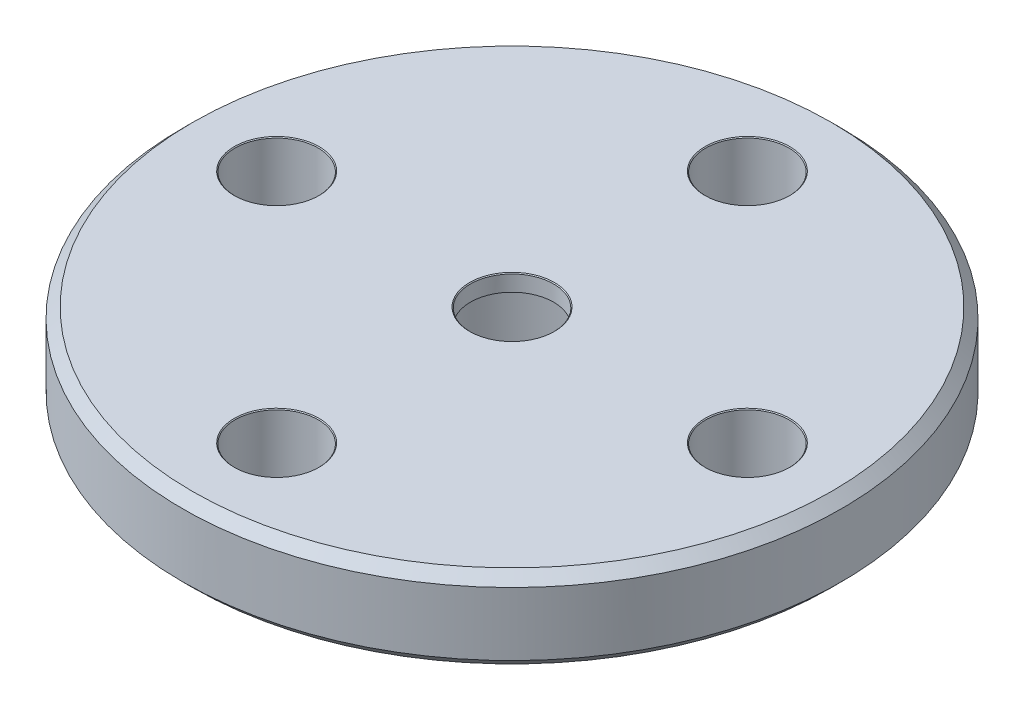
ISO-10303-21;
HEADER;
FILE_DESCRIPTION(('STEP AP214'),'2;1');
FILE_NAME('part.step','',(''),(''),'','','');
FILE_SCHEMA(('AUTOMOTIVE_DESIGN { 1 0 10303 214 1 1 1 1 }'));
ENDSEC;
DATA;
#1=APPLICATION_CONTEXT('core data for automotive mechanical design processes');
#2=APPLICATION_PROTOCOL_DEFINITION('international standard','automotive_design',2000,#1);
#3=PRODUCT_CONTEXT('',#1,'mechanical');
#4=PRODUCT('Part','Part','',(#3));
#5=PRODUCT_RELATED_PRODUCT_CATEGORY('part','',(#4));
#6=PRODUCT_DEFINITION_FORMATION('','',#4);
#7=PRODUCT_DEFINITION_CONTEXT('part definition',#1,'design');
#8=PRODUCT_DEFINITION('design','',#6,#7);
#9=PRODUCT_DEFINITION_SHAPE('','',#8);
#10=(LENGTH_UNIT() NAMED_UNIT(*) SI_UNIT(.MILLI.,.METRE.));
#11=(NAMED_UNIT(*) PLANE_ANGLE_UNIT() SI_UNIT($,.RADIAN.));
#12=(NAMED_UNIT(*) SI_UNIT($,.STERADIAN.) SOLID_ANGLE_UNIT());
#13=UNCERTAINTY_MEASURE_WITH_UNIT(LENGTH_MEASURE(1.E-05),#10,'distance_accuracy_value','');
#14=(GEOMETRIC_REPRESENTATION_CONTEXT(3) GLOBAL_UNCERTAINTY_ASSIGNED_CONTEXT((#13)) GLOBAL_UNIT_ASSIGNED_CONTEXT((#10,
#11,#12)) REPRESENTATION_CONTEXT('',''));
#15=CARTESIAN_POINT('',(0.,0.,0.));
#16=DIRECTION('',(0.,0.,1.));
#17=DIRECTION('',(1.,0.,0.));
#18=AXIS2_PLACEMENT_3D('',#15,#16,#17);
#19=CARTESIAN_POINT('',(0.,4.6,0.));
#20=DIRECTION('',(0.,1.,0.));
#21=DIRECTION('',(0.,0.,1.));
#22=AXIS2_PLACEMENT_3D('',#19,#20,#21);
#23=CYLINDRICAL_SURFACE('',#22,1.25);
#24=CARTESIAN_POINT('',(0.,4.575,0.));
#25=DIRECTION('',(0.,1.,0.));
#26=DIRECTION('',(0.,0.,1.));
#27=AXIS2_PLACEMENT_3D('',#24,#25,#26);
#28=CIRCLE('',#27,1.25);
#29=CARTESIAN_POINT('',(0.,4.575,1.25));
#30=VERTEX_POINT('',#29);
#31=EDGE_CURVE('E112',#30,#30,#28,.T.);
#32=ORIENTED_EDGE('',*,*,#31,.T.);
#33=EDGE_LOOP('',(#32));
#34=FACE_BOUND('',#33,.T.);
#35=CARTESIAN_POINT('',(0.,4.1,0.));
#36=DIRECTION('',(0.,-1.,0.));
#37=DIRECTION('',(0.,0.,-1.));
#38=AXIS2_PLACEMENT_3D('',#35,#36,#37);
#39=CIRCLE('',#38,1.25);
#40=CARTESIAN_POINT('',(0.,4.1,-1.25));
#41=VERTEX_POINT('',#40);
#42=EDGE_CURVE('E82',#41,#41,#39,.F.);
#43=ORIENTED_EDGE('',*,*,#42,.F.);
#44=EDGE_LOOP('',(#43));
#45=FACE_BOUND('',#44,.T.);
#46=ADVANCED_FACE('F45',(#34,#45),#23,.F.);
#47=CARTESIAN_POINT('',(0.,4.6,0.));
#48=DIRECTION('',(0.,-1.,0.));
#49=DIRECTION('',(0.,0.,-1.));
#50=AXIS2_PLACEMENT_3D('',#47,#48,#49);
#51=PLANE('',#50);
#52=CARTESIAN_POINT('',(7.07106781186547,4.6,0.));
#53=DIRECTION('',(0.,1.,0.));
#54=DIRECTION('',(0.,0.,1.));
#55=AXIS2_PLACEMENT_3D('',#52,#53,#54);
#56=CIRCLE('',#55,1.275);
#57=CARTESIAN_POINT('',(7.07106781186547,4.6,1.275));
#58=VERTEX_POINT('',#57);
#59=EDGE_CURVE('E88',#58,#58,#56,.T.);
#60=ORIENTED_EDGE('',*,*,#59,.F.);
#61=EDGE_LOOP('',(#60));
#62=FACE_BOUND('',#61,.T.);
#63=CARTESIAN_POINT('',(0.,4.6,7.07106781186547));
#64=DIRECTION('',(0.,1.,0.));
#65=DIRECTION('',(0.,0.,1.));
#66=AXIS2_PLACEMENT_3D('',#63,#64,#65);
#67=CIRCLE('',#66,1.275);
#68=CARTESIAN_POINT('',(0.,4.6,8.34606781186547));
#69=VERTEX_POINT('',#68);
#70=EDGE_CURVE('E80',#69,#69,#67,.T.);
#71=ORIENTED_EDGE('',*,*,#70,.F.);
#72=EDGE_LOOP('',(#71));
#73=FACE_BOUND('',#72,.T.);
#74=CARTESIAN_POINT('',(-7.07106781186547,4.6,0.));
#75=DIRECTION('',(0.,1.,0.));
#76=DIRECTION('',(0.,0.,1.));
#77=AXIS2_PLACEMENT_3D('',#74,#75,#76);
#78=CIRCLE('',#77,1.275);
#79=CARTESIAN_POINT('',(-7.07106781186547,4.6,1.275));
#80=VERTEX_POINT('',#79);
#81=EDGE_CURVE('E76',#80,#80,#78,.T.);
#82=ORIENTED_EDGE('',*,*,#81,.F.);
#83=EDGE_LOOP('',(#82));
#84=FACE_BOUND('',#83,.T.);
#85=CARTESIAN_POINT('',(0.,4.6,-7.07106781186547));
#86=DIRECTION('',(0.,1.,0.));
#87=DIRECTION('',(0.,0.,1.));
#88=AXIS2_PLACEMENT_3D('',#85,#86,#87);
#89=CIRCLE('',#88,1.275);
#90=CARTESIAN_POINT('',(0.,4.6,-5.79606781186547));
#91=VERTEX_POINT('',#90);
#92=EDGE_CURVE('E71',#91,#91,#89,.T.);
#93=ORIENTED_EDGE('',*,*,#92,.F.);
#94=EDGE_LOOP('',(#93));
#95=FACE_BOUND('',#94,.T.);
#96=CARTESIAN_POINT('',(0.,4.6,0.));
#97=DIRECTION('',(0.,-1.,0.));
#98=DIRECTION('',(0.,0.,-1.));
#99=AXIS2_PLACEMENT_3D('',#96,#97,#98);
#100=CIRCLE('',#99,9.6);
#101=CARTESIAN_POINT('',(0.,4.6,-9.6));
#102=VERTEX_POINT('',#101);
#103=EDGE_CURVE('E11',#102,#102,#100,.F.);
#104=ORIENTED_EDGE('',*,*,#103,.T.);
#105=EDGE_LOOP('',(#104));
#106=FACE_BOUND('',#105,.T.);
#107=CARTESIAN_POINT('',(0.,4.6,0.));
#108=DIRECTION('',(0.,1.,0.));
#109=DIRECTION('',(0.,0.,1.));
#110=AXIS2_PLACEMENT_3D('',#107,#108,#109);
#111=CIRCLE('',#110,1.275);
#112=CARTESIAN_POINT('',(0.,4.6,1.275));
#113=VERTEX_POINT('',#112);
#114=EDGE_CURVE('E66',#113,#113,#111,.T.);
#115=ORIENTED_EDGE('',*,*,#114,.F.);
#116=EDGE_LOOP('',(#115));
#117=FACE_BOUND('',#116,.T.);
#118=ADVANCED_FACE('F145',(#62,#73,#84,#95,#106,#117),#51,.F.);
#119=CARTESIAN_POINT('',(0.,0.,0.));
#120=DIRECTION('',(0.,1.,0.));
#121=DIRECTION('',(0.,0.,1.));
#122=AXIS2_PLACEMENT_3D('',#119,#120,#121);
#123=PLANE('',#122);
#124=CARTESIAN_POINT('',(0.,0.,0.));
#125=DIRECTION('',(0.,1.,0.));
#126=DIRECTION('',(0.,0.,1.));
#127=AXIS2_PLACEMENT_3D('',#124,#125,#126);
#128=CIRCLE('',#127,2.75);
#129=CARTESIAN_POINT('',(0.,0.,2.75));
#130=VERTEX_POINT('',#129);
#131=EDGE_CURVE('E50',#130,#130,#128,.T.);
#132=ORIENTED_EDGE('',*,*,#131,.T.);
#133=EDGE_LOOP('',(#132));
#134=FACE_BOUND('',#133,.T.);
#135=CARTESIAN_POINT('',(0.,0.,0.));
#136=DIRECTION('',(0.,1.,0.));
#137=DIRECTION('',(0.,0.,1.));
#138=AXIS2_PLACEMENT_3D('',#135,#136,#137);
#139=CIRCLE('',#138,4.65);
#140=CARTESIAN_POINT('',(0.,0.,4.65));
#141=VERTEX_POINT('',#140);
#142=EDGE_CURVE('E118',#141,#141,#139,.F.);
#143=ORIENTED_EDGE('',*,*,#142,.T.);
#144=EDGE_LOOP('',(#143));
#145=FACE_BOUND('',#144,.T.);
#146=ADVANCED_FACE('F151',(#134,#145),#123,.F.);
#147=CARTESIAN_POINT('',(0.,0.,0.));
#148=DIRECTION('',(0.,-1.,0.));
#149=DIRECTION('',(0.,0.,-1.));
#150=AXIS2_PLACEMENT_3D('',#147,#148,#149);
#151=CYLINDRICAL_SURFACE('',#150,4.95);
#152=CARTESIAN_POINT('',(0.,0.3,0.));
#153=DIRECTION('',(0.,1.,0.));
#154=DIRECTION('',(0.,0.,1.));
#155=AXIS2_PLACEMENT_3D('',#152,#153,#154);
#156=CIRCLE('',#155,4.95);
#157=CARTESIAN_POINT('',(0.,0.3,4.95));
#158=VERTEX_POINT('',#157);
#159=EDGE_CURVE('E121',#158,#158,#156,.T.);
#160=ORIENTED_EDGE('',*,*,#159,.T.);
#161=EDGE_LOOP('',(#160));
#162=FACE_BOUND('',#161,.T.);
#163=CARTESIAN_POINT('',(0.,2.1,0.));
#164=DIRECTION('',(0.,-1.,0.));
#165=DIRECTION('',(0.,0.,-1.));
#166=AXIS2_PLACEMENT_3D('',#163,#164,#165);
#167=CIRCLE('',#166,4.95);
#168=CARTESIAN_POINT('',(0.,2.1,-4.95));
#169=VERTEX_POINT('',#168);
#170=EDGE_CURVE('E115',#169,#169,#167,.T.);
#171=ORIENTED_EDGE('',*,*,#170,.T.);
#172=EDGE_LOOP('',(#171));
#173=FACE_BOUND('',#172,.T.);
#174=ADVANCED_FACE('F163',(#162,#173),#151,.T.);
#175=CARTESIAN_POINT('',(0.,2.1,0.));
#176=DIRECTION('',(0.,1.,0.));
#177=DIRECTION('',(0.,0.,1.));
#178=AXIS2_PLACEMENT_3D('',#175,#176,#177);
#179=PLANE('',#178);
#180=CARTESIAN_POINT('',(7.07106781186547,2.1,0.));
#181=DIRECTION('',(0.,1.,0.));
#182=DIRECTION('',(0.,0.,1.));
#183=AXIS2_PLACEMENT_3D('',#180,#181,#182);
#184=CIRCLE('',#183,1.25);
#185=CARTESIAN_POINT('',(7.07106781186547,2.1,1.25));
#186=VERTEX_POINT('',#185);
#187=EDGE_CURVE('E78',#186,#186,#184,.T.);
#188=ORIENTED_EDGE('',*,*,#187,.T.);
#189=EDGE_LOOP('',(#188));
#190=FACE_BOUND('',#189,.T.);
#191=CARTESIAN_POINT('',(0.,2.1,7.07106781186547));
#192=DIRECTION('',(0.,1.,0.));
#193=DIRECTION('',(0.,0.,1.));
#194=AXIS2_PLACEMENT_3D('',#191,#192,#193);
#195=CIRCLE('',#194,1.25);
#196=CARTESIAN_POINT('',(0.,2.1,8.32106781186547));
#197=VERTEX_POINT('',#196);
#198=EDGE_CURVE('E73',#197,#197,#195,.T.);
#199=ORIENTED_EDGE('',*,*,#198,.T.);
#200=EDGE_LOOP('',(#199));
#201=FACE_BOUND('',#200,.T.);
#202=CARTESIAN_POINT('',(-7.07106781186547,2.1,0.));
#203=DIRECTION('',(0.,1.,0.));
#204=DIRECTION('',(0.,0.,1.));
#205=AXIS2_PLACEMENT_3D('',#202,#203,#204);
#206=CIRCLE('',#205,1.25);
#207=CARTESIAN_POINT('',(-7.07106781186547,2.1,1.25));
#208=VERTEX_POINT('',#207);
#209=EDGE_CURVE('E68',#208,#208,#206,.T.);
#210=ORIENTED_EDGE('',*,*,#209,.T.);
#211=EDGE_LOOP('',(#210));
#212=FACE_BOUND('',#211,.T.);
#213=CARTESIAN_POINT('',(0.,2.1,-7.07106781186547));
#214=DIRECTION('',(0.,1.,0.));
#215=DIRECTION('',(0.,0.,1.));
#216=AXIS2_PLACEMENT_3D('',#213,#214,#215);
#217=CIRCLE('',#216,1.25);
#218=CARTESIAN_POINT('',(0.,2.1,-5.82106781186548));
#219=VERTEX_POINT('',#218);
#220=EDGE_CURVE('E63',#219,#219,#217,.T.);
#221=ORIENTED_EDGE('',*,*,#220,.T.);
#222=EDGE_LOOP('',(#221));
#223=FACE_BOUND('',#222,.T.);
#224=CARTESIAN_POINT('',(0.,2.1,0.));
#225=DIRECTION('',(0.,1.,0.));
#226=DIRECTION('',(0.,0.,1.));
#227=AXIS2_PLACEMENT_3D('',#224,#225,#226);
#228=CIRCLE('',#227,9.6);
#229=CARTESIAN_POINT('',(0.,2.1,9.6));
#230=VERTEX_POINT('',#229);
#231=EDGE_CURVE('E124',#230,#230,#228,.F.);
#232=ORIENTED_EDGE('',*,*,#231,.T.);
#233=EDGE_LOOP('',(#232));
#234=FACE_BOUND('',#233,.T.);
#235=ORIENTED_EDGE('',*,*,#170,.F.);
#236=EDGE_LOOP('',(#235));
#237=FACE_BOUND('',#236,.T.);
#238=ADVANCED_FACE('F159',(#190,#201,#212,#223,#234,#237),#179,.F.);
#239=CARTESIAN_POINT('',(0.,0.,0.));
#240=DIRECTION('',(0.,-1.,0.));
#241=DIRECTION('',(0.,0.,-1.));
#242=AXIS2_PLACEMENT_3D('',#239,#240,#241);
#243=CYLINDRICAL_SURFACE('',#242,9.9);
#244=CARTESIAN_POINT('',(0.,2.4,0.));
#245=DIRECTION('',(0.,1.,0.));
#246=DIRECTION('',(0.,0.,1.));
#247=AXIS2_PLACEMENT_3D('',#244,#245,#246);
#248=CIRCLE('',#247,9.9);
#249=CARTESIAN_POINT('',(0.,2.4,9.9));
#250=VERTEX_POINT('',#249);
#251=EDGE_CURVE('E54',#250,#250,#248,.T.);
#252=ORIENTED_EDGE('',*,*,#251,.T.);
#253=EDGE_LOOP('',(#252));
#254=FACE_BOUND('',#253,.T.);
#255=CARTESIAN_POINT('',(0.,4.3,0.));
#256=DIRECTION('',(0.,-1.,0.));
#257=DIRECTION('',(0.,0.,-1.));
#258=AXIS2_PLACEMENT_3D('',#255,#256,#257);
#259=CIRCLE('',#258,9.9);
#260=CARTESIAN_POINT('',(0.,4.3,-9.9));
#261=VERTEX_POINT('',#260);
#262=EDGE_CURVE('E59',#261,#261,#259,.T.);
#263=ORIENTED_EDGE('',*,*,#262,.T.);
#264=EDGE_LOOP('',(#263));
#265=FACE_BOUND('',#264,.T.);
#266=ADVANCED_FACE('F129',(#254,#265),#243,.T.);
#267=CARTESIAN_POINT('',(0.,0.,0.));
#268=DIRECTION('',(0.,1.,0.));
#269=DIRECTION('',(0.,0.,1.));
#270=AXIS2_PLACEMENT_3D('',#267,#268,#269);
#271=CONICAL_SURFACE('',#270,4.65,0.785398163397445);
#272=ORIENTED_EDGE('',*,*,#159,.F.);
#273=EDGE_LOOP('',(#272));
#274=FACE_BOUND('',#273,.T.);
#275=ORIENTED_EDGE('',*,*,#142,.F.);
#276=EDGE_LOOP('',(#275));
#277=FACE_BOUND('',#276,.T.);
#278=ADVANCED_FACE('F142',(#274,#277),#271,.T.);
#279=CARTESIAN_POINT('',(0.,2.1,0.));
#280=DIRECTION('',(0.,1.,0.));
#281=DIRECTION('',(0.,0.,1.));
#282=AXIS2_PLACEMENT_3D('',#279,#280,#281);
#283=CONICAL_SURFACE('',#282,9.6,0.785398163397445);
#284=ORIENTED_EDGE('',*,*,#251,.F.);
#285=EDGE_LOOP('',(#284));
#286=FACE_BOUND('',#285,.T.);
#287=ORIENTED_EDGE('',*,*,#231,.F.);
#288=EDGE_LOOP('',(#287));
#289=FACE_BOUND('',#288,.T.);
#290=ADVANCED_FACE('F133',(#286,#289),#283,.T.);
#291=CARTESIAN_POINT('',(0.,4.3,0.));
#292=DIRECTION('',(0.,-1.,0.));
#293=DIRECTION('',(0.,0.,-1.));
#294=AXIS2_PLACEMENT_3D('',#291,#292,#293);
#295=CONICAL_SURFACE('',#294,9.9,0.785398163397448);
#296=ORIENTED_EDGE('',*,*,#103,.F.);
#297=EDGE_LOOP('',(#296));
#298=FACE_BOUND('',#297,.T.);
#299=ORIENTED_EDGE('',*,*,#262,.F.);
#300=EDGE_LOOP('',(#299));
#301=FACE_BOUND('',#300,.T.);
#302=ADVANCED_FACE('F48',(#298,#301),#295,.T.);
#303=CARTESIAN_POINT('',(0.,4.6,0.));
#304=DIRECTION('',(0.,1.,0.));
#305=DIRECTION('',(0.,0.,1.));
#306=AXIS2_PLACEMENT_3D('',#303,#304,#305);
#307=CONICAL_SURFACE('',#306,1.275,0.785398163397461);
#308=ORIENTED_EDGE('',*,*,#31,.F.);
#309=EDGE_LOOP('',(#308));
#310=FACE_BOUND('',#309,.T.);
#311=ORIENTED_EDGE('',*,*,#114,.T.);
#312=EDGE_LOOP('',(#311));
#313=FACE_BOUND('',#312,.T.);
#314=ADVANCED_FACE('F132',(#310,#313),#307,.F.);
#315=CARTESIAN_POINT('',(0.,4.6,-7.07106781186547));
#316=DIRECTION('',(0.,1.,0.));
#317=DIRECTION('',(0.,0.,1.));
#318=AXIS2_PLACEMENT_3D('',#315,#316,#317);
#319=CYLINDRICAL_SURFACE('',#318,1.25);
#320=CARTESIAN_POINT('',(0.,4.575,-7.07106781186547));
#321=DIRECTION('',(0.,1.,0.));
#322=DIRECTION('',(0.,0.,1.));
#323=AXIS2_PLACEMENT_3D('',#320,#321,#322);
#324=CIRCLE('',#323,1.25);
#325=CARTESIAN_POINT('',(0.,4.575,-5.82106781186548));
#326=VERTEX_POINT('',#325);
#327=EDGE_CURVE('E67',#326,#326,#324,.T.);
#328=ORIENTED_EDGE('',*,*,#327,.T.);
#329=EDGE_LOOP('',(#328));
#330=FACE_BOUND('',#329,.T.);
#331=ORIENTED_EDGE('',*,*,#220,.F.);
#332=EDGE_LOOP('',(#331));
#333=FACE_BOUND('',#332,.T.);
#334=ADVANCED_FACE('F139',(#330,#333),#319,.F.);
#335=CARTESIAN_POINT('',(0.,4.6,-7.07106781186547));
#336=DIRECTION('',(0.,1.,0.));
#337=DIRECTION('',(0.,0.,1.));
#338=AXIS2_PLACEMENT_3D('',#335,#336,#337);
#339=CONICAL_SURFACE('',#338,1.275,0.785398163397461);
#340=ORIENTED_EDGE('',*,*,#327,.F.);
#341=EDGE_LOOP('',(#340));
#342=FACE_BOUND('',#341,.T.);
#343=ORIENTED_EDGE('',*,*,#92,.T.);
#344=EDGE_LOOP('',(#343));
#345=FACE_BOUND('',#344,.T.);
#346=ADVANCED_FACE('F218',(#342,#345),#339,.F.);
#347=CARTESIAN_POINT('',(-7.07106781186547,4.6,0.));
#348=DIRECTION('',(0.,1.,0.));
#349=DIRECTION('',(0.,0.,1.));
#350=AXIS2_PLACEMENT_3D('',#347,#348,#349);
#351=CYLINDRICAL_SURFACE('',#350,1.25);
#352=CARTESIAN_POINT('',(-7.07106781186547,4.575,0.));
#353=DIRECTION('',(0.,1.,0.));
#354=DIRECTION('',(0.,0.,1.));
#355=AXIS2_PLACEMENT_3D('',#352,#353,#354);
#356=CIRCLE('',#355,1.25);
#357=CARTESIAN_POINT('',(-7.07106781186547,4.575,1.25));
#358=VERTEX_POINT('',#357);
#359=EDGE_CURVE('E72',#358,#358,#356,.T.);
#360=ORIENTED_EDGE('',*,*,#359,.T.);
#361=EDGE_LOOP('',(#360));
#362=FACE_BOUND('',#361,.T.);
#363=ORIENTED_EDGE('',*,*,#209,.F.);
#364=EDGE_LOOP('',(#363));
#365=FACE_BOUND('',#364,.T.);
#366=ADVANCED_FACE('F228',(#362,#365),#351,.F.);
#367=CARTESIAN_POINT('',(-7.07106781186547,4.6,0.));
#368=DIRECTION('',(0.,1.,0.));
#369=DIRECTION('',(0.,0.,1.));
#370=AXIS2_PLACEMENT_3D('',#367,#368,#369);
#371=CONICAL_SURFACE('',#370,1.275,0.785398163397466);
#372=ORIENTED_EDGE('',*,*,#359,.F.);
#373=EDGE_LOOP('',(#372));
#374=FACE_BOUND('',#373,.T.);
#375=ORIENTED_EDGE('',*,*,#81,.T.);
#376=EDGE_LOOP('',(#375));
#377=FACE_BOUND('',#376,.T.);
#378=ADVANCED_FACE('F238',(#374,#377),#371,.F.);
#379=CARTESIAN_POINT('',(0.,4.6,7.07106781186547));
#380=DIRECTION('',(0.,1.,0.));
#381=DIRECTION('',(0.,0.,1.));
#382=AXIS2_PLACEMENT_3D('',#379,#380,#381);
#383=CYLINDRICAL_SURFACE('',#382,1.25);
#384=CARTESIAN_POINT('',(0.,4.575,7.07106781186547));
#385=DIRECTION('',(0.,1.,0.));
#386=DIRECTION('',(0.,0.,1.));
#387=AXIS2_PLACEMENT_3D('',#384,#385,#386);
#388=CIRCLE('',#387,1.25);
#389=CARTESIAN_POINT('',(0.,4.575,8.32106781186547));
#390=VERTEX_POINT('',#389);
#391=EDGE_CURVE('E77',#390,#390,#388,.T.);
#392=ORIENTED_EDGE('',*,*,#391,.T.);
#393=EDGE_LOOP('',(#392));
#394=FACE_BOUND('',#393,.T.);
#395=ORIENTED_EDGE('',*,*,#198,.F.);
#396=EDGE_LOOP('',(#395));
#397=FACE_BOUND('',#396,.T.);
#398=ADVANCED_FACE('F247',(#394,#397),#383,.F.);
#399=CARTESIAN_POINT('',(0.,4.6,7.07106781186547));
#400=DIRECTION('',(0.,1.,0.));
#401=DIRECTION('',(0.,0.,1.));
#402=AXIS2_PLACEMENT_3D('',#399,#400,#401);
#403=CONICAL_SURFACE('',#402,1.275,0.785398163397461);
#404=ORIENTED_EDGE('',*,*,#391,.F.);
#405=EDGE_LOOP('',(#404));
#406=FACE_BOUND('',#405,.T.);
#407=ORIENTED_EDGE('',*,*,#70,.T.);
#408=EDGE_LOOP('',(#407));
#409=FACE_BOUND('',#408,.T.);
#410=ADVANCED_FACE('F258',(#406,#409),#403,.F.);
#411=CARTESIAN_POINT('',(7.07106781186547,4.6,0.));
#412=DIRECTION('',(0.,1.,0.));
#413=DIRECTION('',(0.,0.,1.));
#414=AXIS2_PLACEMENT_3D('',#411,#412,#413);
#415=CYLINDRICAL_SURFACE('',#414,1.25);
#416=CARTESIAN_POINT('',(7.07106781186547,4.575,0.));
#417=DIRECTION('',(0.,1.,0.));
#418=DIRECTION('',(0.,0.,1.));
#419=AXIS2_PLACEMENT_3D('',#416,#417,#418);
#420=CIRCLE('',#419,1.25);
#421=CARTESIAN_POINT('',(7.07106781186547,4.575,1.25));
#422=VERTEX_POINT('',#421);
#423=EDGE_CURVE('E81',#422,#422,#420,.T.);
#424=ORIENTED_EDGE('',*,*,#423,.T.);
#425=EDGE_LOOP('',(#424));
#426=FACE_BOUND('',#425,.T.);
#427=ORIENTED_EDGE('',*,*,#187,.F.);
#428=EDGE_LOOP('',(#427));
#429=FACE_BOUND('',#428,.T.);
#430=ADVANCED_FACE('F268',(#426,#429),#415,.F.);
#431=CARTESIAN_POINT('',(7.07106781186547,4.6,0.));
#432=DIRECTION('',(0.,1.,0.));
#433=DIRECTION('',(0.,0.,1.));
#434=AXIS2_PLACEMENT_3D('',#431,#432,#433);
#435=CONICAL_SURFACE('',#434,1.275,0.785398163397466);
#436=ORIENTED_EDGE('',*,*,#423,.F.);
#437=EDGE_LOOP('',(#436));
#438=FACE_BOUND('',#437,.T.);
#439=ORIENTED_EDGE('',*,*,#59,.T.);
#440=EDGE_LOOP('',(#439));
#441=FACE_BOUND('',#440,.T.);
#442=ADVANCED_FACE('F278',(#438,#441),#435,.F.);
#443=CARTESIAN_POINT('',(0.,12.378174593052,0.));
#444=DIRECTION('',(0.,-1.,0.));
#445=DIRECTION('',(0.,0.,-1.));
#446=AXIS2_PLACEMENT_3D('',#443,#444,#445);
#447=CYLINDRICAL_SURFACE('',#446,2.75);
#448=CARTESIAN_POINT('',(0.,4.1,0.));
#449=DIRECTION('',(0.,-1.,0.));
#450=DIRECTION('',(0.,0.,-1.));
#451=AXIS2_PLACEMENT_3D('',#448,#449,#450);
#452=CIRCLE('',#451,2.75);
#453=CARTESIAN_POINT('',(0.,4.1,-2.75));
#454=VERTEX_POINT('',#453);
#455=EDGE_CURVE('E84',#454,#454,#452,.F.);
#456=ORIENTED_EDGE('',*,*,#455,.T.);
#457=EDGE_LOOP('',(#456));
#458=FACE_BOUND('',#457,.T.);
#459=ORIENTED_EDGE('',*,*,#131,.F.);
#460=EDGE_LOOP('',(#459));
#461=FACE_BOUND('',#460,.T.);
#462=ADVANCED_FACE('F287',(#458,#461),#447,.F.);
#463=CARTESIAN_POINT('',(0.,4.1,0.));
#464=DIRECTION('',(0.,-1.,0.));
#465=DIRECTION('',(0.,0.,-1.));
#466=AXIS2_PLACEMENT_3D('',#463,#464,#465);
#467=PLANE('',#466);
#468=ORIENTED_EDGE('',*,*,#455,.F.);
#469=EDGE_LOOP('',(#468));
#470=FACE_BOUND('',#469,.T.);
#471=ORIENTED_EDGE('',*,*,#42,.T.);
#472=EDGE_LOOP('',(#471));
#473=FACE_BOUND('',#472,.T.);
#474=ADVANCED_FACE('F298',(#470,#473),#467,.T.);
#475=CLOSED_SHELL('',(#46,#118,#146,#174,#238,#266,#278,#290,#302,#314,#334,#346,#366,#378,#398,
#410,#430,#442,#462,#474));
#476=MANIFOLD_SOLID_BREP('B2',#475);
#477=ADVANCED_BREP_SHAPE_REPRESENTATION('',(#18,#476),#14);
#478=SHAPE_DEFINITION_REPRESENTATION(#9,#477);
ENDSEC;
END-ISO-10303-21;
